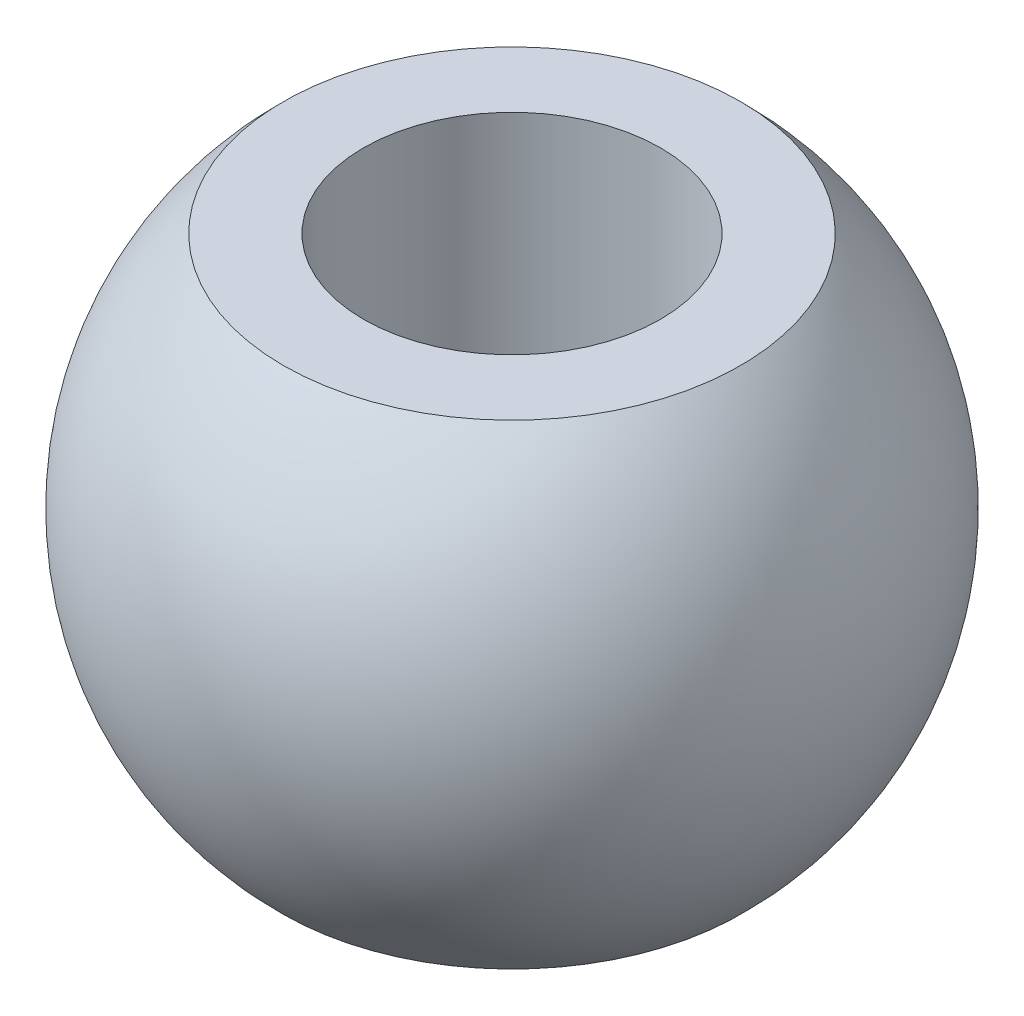
ISO-10303-21;
HEADER;
FILE_DESCRIPTION(('STEP AP214'),'2;1');
FILE_NAME('part.step','',(''),(''),'','','');
FILE_SCHEMA(('AUTOMOTIVE_DESIGN { 1 0 10303 214 1 1 1 1 }'));
ENDSEC;
DATA;
#1=APPLICATION_CONTEXT('core data for automotive mechanical design processes');
#2=APPLICATION_PROTOCOL_DEFINITION('international standard','automotive_design',2000,#1);
#3=PRODUCT_CONTEXT('',#1,'mechanical');
#4=PRODUCT('Part','Part','',(#3));
#5=PRODUCT_RELATED_PRODUCT_CATEGORY('part','',(#4));
#6=PRODUCT_DEFINITION_FORMATION('','',#4);
#7=PRODUCT_DEFINITION_CONTEXT('part definition',#1,'design');
#8=PRODUCT_DEFINITION('design','',#6,#7);
#9=PRODUCT_DEFINITION_SHAPE('','',#8);
#10=(LENGTH_UNIT() NAMED_UNIT(*) SI_UNIT(.MILLI.,.METRE.));
#11=(NAMED_UNIT(*) PLANE_ANGLE_UNIT() SI_UNIT($,.RADIAN.));
#12=(NAMED_UNIT(*) SI_UNIT($,.STERADIAN.) SOLID_ANGLE_UNIT());
#13=UNCERTAINTY_MEASURE_WITH_UNIT(LENGTH_MEASURE(1.E-05),#10,'distance_accuracy_value','');
#14=(GEOMETRIC_REPRESENTATION_CONTEXT(3) GLOBAL_UNCERTAINTY_ASSIGNED_CONTEXT((#13)) GLOBAL_UNIT_ASSIGNED_CONTEXT((#10,
#11,#12)) REPRESENTATION_CONTEXT('',''));
#15=CARTESIAN_POINT('',(0.,0.,0.));
#16=DIRECTION('',(0.,0.,1.));
#17=DIRECTION('',(1.,0.,0.));
#18=AXIS2_PLACEMENT_3D('',#15,#16,#17);
#19=CARTESIAN_POINT('',(0.,0.,0.));
#20=DIRECTION('',(0.,-1.,0.));
#21=DIRECTION('',(0.,0.,-1.));
#22=AXIS2_PLACEMENT_3D('',#19,#20,#21);
#23=CYLINDRICAL_SURFACE('',#22,2.5);
#24=CARTESIAN_POINT('',(0.,-4.,0.));
#25=DIRECTION('',(0.,-1.,0.));
#26=DIRECTION('',(0.,0.,-1.));
#27=AXIS2_PLACEMENT_3D('',#24,#25,#26);
#28=CIRCLE('',#27,2.5);
#29=CARTESIAN_POINT('',(0.,-4.,-2.5));
#30=VERTEX_POINT('',#29);
#31=EDGE_CURVE('E26',#30,#30,#28,.F.);
#32=ORIENTED_EDGE('',*,*,#31,.F.);
#33=EDGE_LOOP('',(#32));
#34=FACE_BOUND('',#33,.T.);
#35=CARTESIAN_POINT('',(0.,4.,0.));
#36=DIRECTION('',(0.,-1.,0.));
#37=DIRECTION('',(0.,0.,-1.));
#38=AXIS2_PLACEMENT_3D('',#35,#36,#37);
#39=CIRCLE('',#38,2.5);
#40=CARTESIAN_POINT('',(0.,4.,-2.5));
#41=VERTEX_POINT('',#40);
#42=EDGE_CURVE('E17',#41,#41,#39,.T.);
#43=ORIENTED_EDGE('',*,*,#42,.F.);
#44=EDGE_LOOP('',(#43));
#45=FACE_BOUND('',#44,.T.);
#46=ADVANCED_FACE('F14',(#34,#45),#23,.F.);
#47=CARTESIAN_POINT('',(0.,4.,0.));
#48=DIRECTION('',(0.,1.,0.));
#49=DIRECTION('',(0.,0.,1.));
#50=AXIS2_PLACEMENT_3D('',#47,#48,#49);
#51=PLANE('',#50);
#52=ORIENTED_EDGE('',*,*,#42,.T.);
#53=EDGE_LOOP('',(#52));
#54=FACE_BOUND('',#53,.T.);
#55=CARTESIAN_POINT('',(0.,4.,0.));
#56=DIRECTION('',(0.,1.,0.));
#57=DIRECTION('',(0.,0.,1.));
#58=AXIS2_PLACEMENT_3D('',#55,#56,#57);
#59=CIRCLE('',#58,3.84740172064213);
#60=CARTESIAN_POINT('',(0.,4.,3.84740172064213));
#61=VERTEX_POINT('',#60);
#62=EDGE_CURVE('E21',#61,#61,#59,.F.);
#63=ORIENTED_EDGE('',*,*,#62,.F.);
#64=EDGE_LOOP('',(#63));
#65=FACE_BOUND('',#64,.T.);
#66=ADVANCED_FACE('F36',(#54,#65),#51,.T.);
#67=CARTESIAN_POINT('',(0.,-4.,0.));
#68=DIRECTION('',(0.,-1.,0.));
#69=DIRECTION('',(0.,0.,-1.));
#70=AXIS2_PLACEMENT_3D('',#67,#68,#69);
#71=PLANE('',#70);
#72=ORIENTED_EDGE('',*,*,#31,.T.);
#73=EDGE_LOOP('',(#72));
#74=FACE_BOUND('',#73,.T.);
#75=CARTESIAN_POINT('',(0.,-4.,0.));
#76=DIRECTION('',(0.,1.,0.));
#77=DIRECTION('',(0.,0.,1.));
#78=AXIS2_PLACEMENT_3D('',#75,#76,#77);
#79=CIRCLE('',#78,3.84740172064213);
#80=CARTESIAN_POINT('',(0.,-4.,3.84740172064213));
#81=VERTEX_POINT('',#80);
#82=EDGE_CURVE('E10',#81,#81,#79,.T.);
#83=ORIENTED_EDGE('',*,*,#82,.F.);
#84=EDGE_LOOP('',(#83));
#85=FACE_BOUND('',#84,.T.);
#86=ADVANCED_FACE('F44',(#74,#85),#71,.T.);
#87=CARTESIAN_POINT('',(0.,0.,0.));
#88=DIRECTION('',(0.,1.,0.));
#89=DIRECTION('',(-1.,0.,0.));
#90=AXIS2_PLACEMENT_3D('',#87,#88,#89);
#91=SPHERICAL_SURFACE('',#90,5.55);
#92=ORIENTED_EDGE('',*,*,#62,.T.);
#93=EDGE_LOOP('',(#92));
#94=FACE_BOUND('',#93,.T.);
#95=ORIENTED_EDGE('',*,*,#82,.T.);
#96=EDGE_LOOP('',(#95));
#97=FACE_BOUND('',#96,.T.);
#98=ADVANCED_FACE('F45',(#94,#97),#91,.T.);
#99=CLOSED_SHELL('',(#46,#66,#86,#98));
#100=MANIFOLD_SOLID_BREP('B1',#99);
#101=ADVANCED_BREP_SHAPE_REPRESENTATION('',(#18,#100),#14);
#102=SHAPE_DEFINITION_REPRESENTATION(#9,#101);
ENDSEC;
END-ISO-10303-21;
